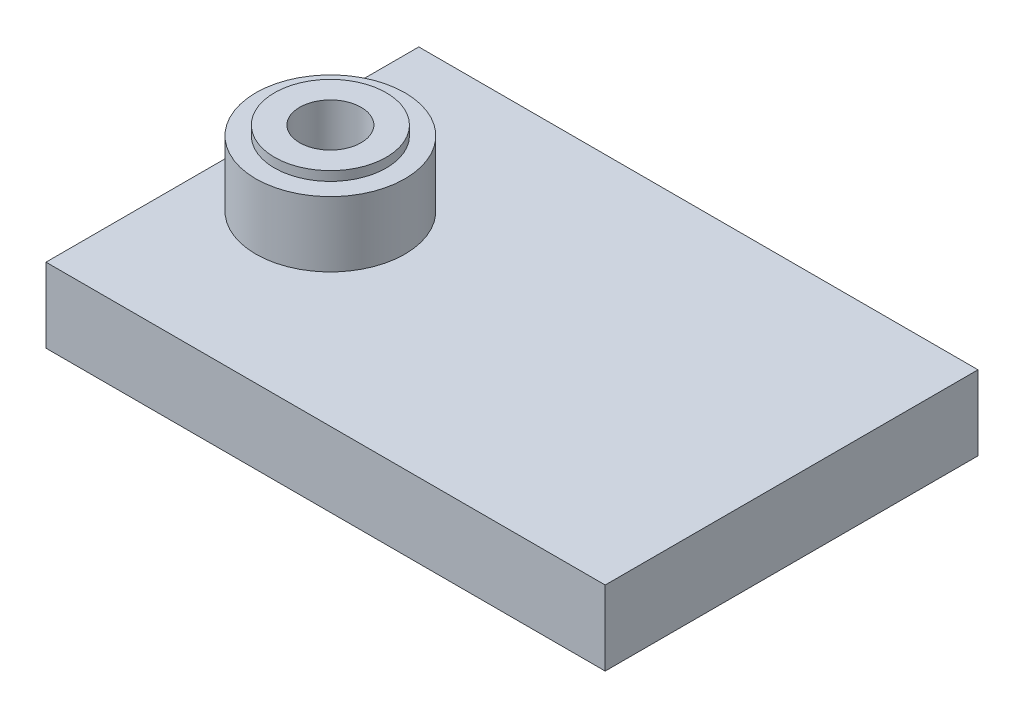
ISO-10303-21;
HEADER;
FILE_DESCRIPTION(('STEP AP214'),'2;1');
FILE_NAME('part.step','',(''),(''),'','','');
FILE_SCHEMA(('AUTOMOTIVE_DESIGN { 1 0 10303 214 1 1 1 1 }'));
ENDSEC;
DATA;
#1=APPLICATION_CONTEXT('core data for automotive mechanical design processes');
#2=APPLICATION_PROTOCOL_DEFINITION('international standard','automotive_design',2000,#1);
#3=PRODUCT_CONTEXT('',#1,'mechanical');
#4=PRODUCT('Part','Part','',(#3));
#5=PRODUCT_RELATED_PRODUCT_CATEGORY('part','',(#4));
#6=PRODUCT_DEFINITION_FORMATION('','',#4);
#7=PRODUCT_DEFINITION_CONTEXT('part definition',#1,'design');
#8=PRODUCT_DEFINITION('design','',#6,#7);
#9=PRODUCT_DEFINITION_SHAPE('','',#8);
#10=(LENGTH_UNIT() NAMED_UNIT(*) SI_UNIT(.MILLI.,.METRE.));
#11=(NAMED_UNIT(*) PLANE_ANGLE_UNIT() SI_UNIT($,.RADIAN.));
#12=(NAMED_UNIT(*) SI_UNIT($,.STERADIAN.) SOLID_ANGLE_UNIT());
#13=UNCERTAINTY_MEASURE_WITH_UNIT(LENGTH_MEASURE(1.E-05),#10,'distance_accuracy_value','');
#14=(GEOMETRIC_REPRESENTATION_CONTEXT(3) GLOBAL_UNCERTAINTY_ASSIGNED_CONTEXT((#13)) GLOBAL_UNIT_ASSIGNED_CONTEXT((#10,
#11,#12)) REPRESENTATION_CONTEXT('',''));
#15=CARTESIAN_POINT('',(0.,0.,0.));
#16=DIRECTION('',(0.,0.,1.));
#17=DIRECTION('',(1.,0.,0.));
#18=AXIS2_PLACEMENT_3D('',#15,#16,#17);
#19=CARTESIAN_POINT('',(24.74321034,4.,-10.));
#20=DIRECTION('',(-1.,0.,0.));
#21=DIRECTION('',(0.,0.,1.));
#22=AXIS2_PLACEMENT_3D('',#19,#20,#21);
#23=PLANE('',#22);
#24=DIRECTION('',(0.,0.,-1.));
#25=VECTOR('',#24,1.);
#26=CARTESIAN_POINT('',(24.74321034,0.,-10.));
#27=LINE('',#26,#25);
#28=CARTESIAN_POINT('',(24.74321034,0.,10.));
#29=VERTEX_POINT('',#28);
#30=CARTESIAN_POINT('',(24.74321034,0.,-10.));
#31=VERTEX_POINT('',#30);
#32=EDGE_CURVE('E103',#29,#31,#27,.T.);
#33=ORIENTED_EDGE('',*,*,#32,.T.);
#34=DIRECTION('',(0.,-1.,0.));
#35=VECTOR('',#34,1.);
#36=CARTESIAN_POINT('',(24.74321034,4.,-10.));
#37=LINE('',#36,#35);
#38=CARTESIAN_POINT('',(24.74321034,4.,-10.));
#39=VERTEX_POINT('',#38);
#40=EDGE_CURVE('E94',#39,#31,#37,.T.);
#41=ORIENTED_EDGE('',*,*,#40,.F.);
#42=DIRECTION('',(0.,0.,-1.));
#43=VECTOR('',#42,1.);
#44=CARTESIAN_POINT('',(24.74321034,4.,-10.));
#45=LINE('',#44,#43);
#46=CARTESIAN_POINT('',(24.74321034,4.,10.));
#47=VERTEX_POINT('',#46);
#48=EDGE_CURVE('E88',#47,#39,#45,.T.);
#49=ORIENTED_EDGE('',*,*,#48,.F.);
#50=DIRECTION('',(0.,-1.,0.));
#51=VECTOR('',#50,1.);
#52=CARTESIAN_POINT('',(24.74321034,4.,10.));
#53=LINE('',#52,#51);
#54=EDGE_CURVE('E99',#47,#29,#53,.T.);
#55=ORIENTED_EDGE('',*,*,#54,.T.);
#56=EDGE_LOOP('',(#33,#41,#49,#55));
#57=FACE_BOUND('',#56,.T.);
#58=ADVANCED_FACE('F35',(#57),#23,.F.);
#59=CARTESIAN_POINT('',(24.74321034,4.,-10.));
#60=DIRECTION('',(0.,0.,1.));
#61=DIRECTION('',(1.,0.,0.));
#62=AXIS2_PLACEMENT_3D('',#59,#60,#61);
#63=PLANE('',#62);
#64=DIRECTION('',(-1.,0.,0.));
#65=VECTOR('',#64,1.);
#66=CARTESIAN_POINT('',(24.74321034,0.,-10.));
#67=LINE('',#66,#65);
#68=CARTESIAN_POINT('',(-5.25678966000001,0.,-9.99999999999999));
#69=VERTEX_POINT('',#68);
#70=EDGE_CURVE('E93',#31,#69,#67,.T.);
#71=ORIENTED_EDGE('',*,*,#70,.T.);
#72=DIRECTION('',(0.,-1.,0.));
#73=VECTOR('',#72,1.);
#74=CARTESIAN_POINT('',(-5.25678966000001,4.,-9.99999999999999));
#75=LINE('',#74,#73);
#76=CARTESIAN_POINT('',(-5.25678966000001,4.,-9.99999999999999));
#77=VERTEX_POINT('',#76);
#78=EDGE_CURVE('E91',#77,#69,#75,.T.);
#79=ORIENTED_EDGE('',*,*,#78,.F.);
#80=DIRECTION('',(-1.,0.,0.));
#81=VECTOR('',#80,1.);
#82=CARTESIAN_POINT('',(24.74321034,4.,-10.));
#83=LINE('',#82,#81);
#84=EDGE_CURVE('E83',#39,#77,#83,.T.);
#85=ORIENTED_EDGE('',*,*,#84,.F.);
#86=ORIENTED_EDGE('',*,*,#40,.T.);
#87=EDGE_LOOP('',(#71,#79,#85,#86));
#88=FACE_BOUND('',#87,.T.);
#89=ADVANCED_FACE('F92',(#88),#63,.F.);
#90=CARTESIAN_POINT('',(-5.25678966000001,4.,-9.99999999999999));
#91=DIRECTION('',(1.,0.,0.));
#92=DIRECTION('',(0.,0.,-1.));
#93=AXIS2_PLACEMENT_3D('',#90,#91,#92);
#94=PLANE('',#93);
#95=DIRECTION('',(0.,0.,1.));
#96=VECTOR('',#95,1.);
#97=CARTESIAN_POINT('',(-5.25678966000001,0.,-9.99999999999999));
#98=LINE('',#97,#96);
#99=CARTESIAN_POINT('',(-5.25678966,0.,10.));
#100=VERTEX_POINT('',#99);
#101=EDGE_CURVE('E69',#69,#100,#98,.T.);
#102=ORIENTED_EDGE('',*,*,#101,.T.);
#103=DIRECTION('',(0.,-1.,0.));
#104=VECTOR('',#103,1.);
#105=CARTESIAN_POINT('',(-5.25678966,4.,10.));
#106=LINE('',#105,#104);
#107=CARTESIAN_POINT('',(-5.25678966,4.,10.));
#108=VERTEX_POINT('',#107);
#109=EDGE_CURVE('E95',#108,#100,#106,.T.);
#110=ORIENTED_EDGE('',*,*,#109,.F.);
#111=DIRECTION('',(0.,0.,1.));
#112=VECTOR('',#111,1.);
#113=CARTESIAN_POINT('',(-5.25678966000001,4.,-9.99999999999999));
#114=LINE('',#113,#112);
#115=EDGE_CURVE('E86',#77,#108,#114,.T.);
#116=ORIENTED_EDGE('',*,*,#115,.F.);
#117=ORIENTED_EDGE('',*,*,#78,.T.);
#118=EDGE_LOOP('',(#102,#110,#116,#117));
#119=FACE_BOUND('',#118,.T.);
#120=ADVANCED_FACE('F97',(#119),#94,.F.);
#121=CARTESIAN_POINT('',(24.74321034,4.,10.));
#122=DIRECTION('',(0.,0.,-1.));
#123=DIRECTION('',(-1.,0.,0.));
#124=AXIS2_PLACEMENT_3D('',#121,#122,#123);
#125=PLANE('',#124);
#126=DIRECTION('',(1.,0.,0.));
#127=VECTOR('',#126,1.);
#128=CARTESIAN_POINT('',(24.74321034,0.,10.));
#129=LINE('',#128,#127);
#130=EDGE_CURVE('E75',#100,#29,#129,.T.);
#131=ORIENTED_EDGE('',*,*,#130,.T.);
#132=ORIENTED_EDGE('',*,*,#54,.F.);
#133=DIRECTION('',(1.,0.,0.));
#134=VECTOR('',#133,1.);
#135=CARTESIAN_POINT('',(24.74321034,4.,10.));
#136=LINE('',#135,#134);
#137=EDGE_CURVE('E52',#108,#47,#136,.T.);
#138=ORIENTED_EDGE('',*,*,#137,.F.);
#139=ORIENTED_EDGE('',*,*,#109,.T.);
#140=EDGE_LOOP('',(#131,#132,#138,#139));
#141=FACE_BOUND('',#140,.T.);
#142=ADVANCED_FACE('F118',(#141),#125,.F.);
#143=CARTESIAN_POINT('',(0.,4.,0.));
#144=DIRECTION('',(0.,-1.,0.));
#145=DIRECTION('',(0.,0.,-1.));
#146=AXIS2_PLACEMENT_3D('',#143,#144,#145);
#147=PLANE('',#146);
#148=CARTESIAN_POINT('',(0.,4.,0.));
#149=DIRECTION('',(0.,-1.,0.));
#150=DIRECTION('',(0.,0.,-1.));
#151=AXIS2_PLACEMENT_3D('',#148,#149,#150);
#152=CIRCLE('',#151,4.);
#153=CARTESIAN_POINT('',(0.,4.,-4.));
#154=VERTEX_POINT('',#153);
#155=EDGE_CURVE('E38',#154,#154,#152,.F.);
#156=ORIENTED_EDGE('',*,*,#155,.F.);
#157=EDGE_LOOP('',(#156));
#158=FACE_BOUND('',#157,.T.);
#159=ORIENTED_EDGE('',*,*,#48,.T.);
#160=ORIENTED_EDGE('',*,*,#84,.T.);
#161=ORIENTED_EDGE('',*,*,#115,.T.);
#162=ORIENTED_EDGE('',*,*,#137,.T.);
#163=EDGE_LOOP('',(#159,#160,#161,#162));
#164=FACE_BOUND('',#163,.T.);
#165=ADVANCED_FACE('F84',(#158,#164),#147,.F.);
#166=CARTESIAN_POINT('',(0.,0.,0.));
#167=DIRECTION('',(0.,-1.,0.));
#168=DIRECTION('',(0.,0.,-1.));
#169=AXIS2_PLACEMENT_3D('',#166,#167,#168);
#170=PLANE('',#169);
#171=CARTESIAN_POINT('',(0.,0.,0.));
#172=DIRECTION('',(0.,-1.,0.));
#173=DIRECTION('',(0.,0.,-1.));
#174=AXIS2_PLACEMENT_3D('',#171,#172,#173);
#175=CIRCLE('',#174,1.65);
#176=CARTESIAN_POINT('',(0.,0.,-1.65));
#177=VERTEX_POINT('',#176);
#178=EDGE_CURVE('E138',#177,#177,#175,.T.);
#179=ORIENTED_EDGE('',*,*,#178,.F.);
#180=EDGE_LOOP('',(#179));
#181=FACE_BOUND('',#180,.T.);
#182=ORIENTED_EDGE('',*,*,#32,.F.);
#183=ORIENTED_EDGE('',*,*,#130,.F.);
#184=ORIENTED_EDGE('',*,*,#101,.F.);
#185=ORIENTED_EDGE('',*,*,#70,.F.);
#186=EDGE_LOOP('',(#182,#183,#184,#185));
#187=FACE_BOUND('',#186,.T.);
#188=ADVANCED_FACE('F117',(#181,#187),#170,.T.);
#189=CARTESIAN_POINT('',(0.,7.5,0.));
#190=DIRECTION('',(0.,-1.,0.));
#191=DIRECTION('',(0.,0.,-1.));
#192=AXIS2_PLACEMENT_3D('',#189,#190,#191);
#193=CYLINDRICAL_SURFACE('',#192,4.);
#194=CARTESIAN_POINT('',(0.,7.5,0.));
#195=DIRECTION('',(0.,1.,0.));
#196=DIRECTION('',(0.,0.,1.));
#197=AXIS2_PLACEMENT_3D('',#194,#195,#196);
#198=CIRCLE('',#197,4.);
#199=CARTESIAN_POINT('',(0.,7.5,4.));
#200=VERTEX_POINT('',#199);
#201=EDGE_CURVE('E106',#200,#200,#198,.T.);
#202=ORIENTED_EDGE('',*,*,#201,.F.);
#203=EDGE_LOOP('',(#202));
#204=FACE_BOUND('',#203,.T.);
#205=ORIENTED_EDGE('',*,*,#155,.T.);
#206=EDGE_LOOP('',(#205));
#207=FACE_BOUND('',#206,.T.);
#208=ADVANCED_FACE('F114',(#204,#207),#193,.T.);
#209=CARTESIAN_POINT('',(0.,7.5,0.));
#210=DIRECTION('',(0.,1.,0.));
#211=DIRECTION('',(0.,0.,1.));
#212=AXIS2_PLACEMENT_3D('',#209,#210,#211);
#213=PLANE('',#212);
#214=CARTESIAN_POINT('',(0.,7.5,0.));
#215=DIRECTION('',(0.,1.,0.));
#216=DIRECTION('',(0.,0.,1.));
#217=AXIS2_PLACEMENT_3D('',#214,#215,#216);
#218=CIRCLE('',#217,3.);
#219=CARTESIAN_POINT('',(0.,7.5,3.));
#220=VERTEX_POINT('',#219);
#221=EDGE_CURVE('E11',#220,#220,#218,.T.);
#222=ORIENTED_EDGE('',*,*,#221,.F.);
#223=EDGE_LOOP('',(#222));
#224=FACE_BOUND('',#223,.T.);
#225=ORIENTED_EDGE('',*,*,#201,.T.);
#226=EDGE_LOOP('',(#225));
#227=FACE_BOUND('',#226,.T.);
#228=ADVANCED_FACE('F161',(#224,#227),#213,.T.);
#229=CARTESIAN_POINT('',(0.,0.,0.));
#230=DIRECTION('',(0.,-1.,0.));
#231=DIRECTION('',(0.,0.,-1.));
#232=AXIS2_PLACEMENT_3D('',#229,#230,#231);
#233=CYLINDRICAL_SURFACE('',#232,1.65);
#234=ORIENTED_EDGE('',*,*,#178,.T.);
#235=EDGE_LOOP('',(#234));
#236=FACE_BOUND('',#235,.T.);
#237=CARTESIAN_POINT('',(0.,8.,0.));
#238=DIRECTION('',(0.,1.,0.));
#239=DIRECTION('',(0.,0.,1.));
#240=AXIS2_PLACEMENT_3D('',#237,#238,#239);
#241=CIRCLE('',#240,1.65);
#242=CARTESIAN_POINT('',(0.,8.,1.65));
#243=VERTEX_POINT('',#242);
#244=EDGE_CURVE('E144',#243,#243,#241,.T.);
#245=ORIENTED_EDGE('',*,*,#244,.T.);
#246=EDGE_LOOP('',(#245));
#247=FACE_BOUND('',#246,.T.);
#248=ADVANCED_FACE('F148',(#236,#247),#233,.F.);
#249=CARTESIAN_POINT('',(0.,8.,0.));
#250=DIRECTION('',(0.,1.,0.));
#251=DIRECTION('',(0.,0.,1.));
#252=AXIS2_PLACEMENT_3D('',#249,#250,#251);
#253=PLANE('',#252);
#254=CARTESIAN_POINT('',(0.,8.,0.));
#255=DIRECTION('',(0.,1.,0.));
#256=DIRECTION('',(0.,0.,1.));
#257=AXIS2_PLACEMENT_3D('',#254,#255,#256);
#258=CIRCLE('',#257,3.);
#259=CARTESIAN_POINT('',(0.,8.,3.));
#260=VERTEX_POINT('',#259);
#261=EDGE_CURVE('E140',#260,#260,#258,.T.);
#262=ORIENTED_EDGE('',*,*,#261,.T.);
#263=EDGE_LOOP('',(#262));
#264=FACE_BOUND('',#263,.T.);
#265=ORIENTED_EDGE('',*,*,#244,.F.);
#266=EDGE_LOOP('',(#265));
#267=FACE_BOUND('',#266,.T.);
#268=ADVANCED_FACE('F150',(#264,#267),#253,.T.);
#269=CARTESIAN_POINT('',(0.,8.,0.));
#270=DIRECTION('',(0.,-1.,0.));
#271=DIRECTION('',(0.,0.,-1.));
#272=AXIS2_PLACEMENT_3D('',#269,#270,#271);
#273=CYLINDRICAL_SURFACE('',#272,3.);
#274=ORIENTED_EDGE('',*,*,#261,.F.);
#275=EDGE_LOOP('',(#274));
#276=FACE_BOUND('',#275,.T.);
#277=ORIENTED_EDGE('',*,*,#221,.T.);
#278=EDGE_LOOP('',(#277));
#279=FACE_BOUND('',#278,.T.);
#280=ADVANCED_FACE('F152',(#276,#279),#273,.T.);
#281=CLOSED_SHELL('',(#58,#89,#120,#142,#165,#188,#208,#228,#248,#268,#280));
#282=MANIFOLD_SOLID_BREP('B2',#281);
#283=ADVANCED_BREP_SHAPE_REPRESENTATION('',(#18,#282),#14);
#284=SHAPE_DEFINITION_REPRESENTATION(#9,#283);
ENDSEC;
END-ISO-10303-21;
